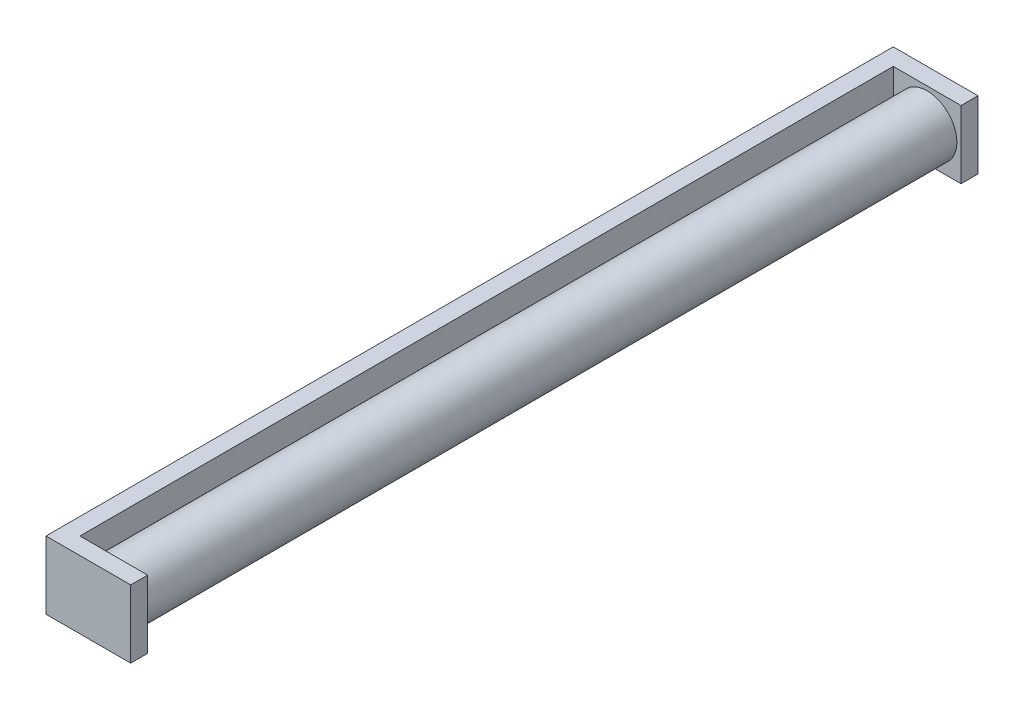
ISO-10303-21;
HEADER;
FILE_DESCRIPTION(('STEP AP214'),'2;1');
FILE_NAME('part.step','',(''),(''),'','','');
FILE_SCHEMA(('AUTOMOTIVE_DESIGN { 1 0 10303 214 1 1 1 1 }'));
ENDSEC;
DATA;
#1=APPLICATION_CONTEXT('core data for automotive mechanical design processes');
#2=APPLICATION_PROTOCOL_DEFINITION('international standard','automotive_design',2000,#1);
#3=PRODUCT_CONTEXT('',#1,'mechanical');
#4=PRODUCT('Part','Part','',(#3));
#5=PRODUCT_RELATED_PRODUCT_CATEGORY('part','',(#4));
#6=PRODUCT_DEFINITION_FORMATION('','',#4);
#7=PRODUCT_DEFINITION_CONTEXT('part definition',#1,'design');
#8=PRODUCT_DEFINITION('design','',#6,#7);
#9=PRODUCT_DEFINITION_SHAPE('','',#8);
#10=(LENGTH_UNIT() NAMED_UNIT(*) SI_UNIT(.MILLI.,.METRE.));
#11=(NAMED_UNIT(*) PLANE_ANGLE_UNIT() SI_UNIT($,.RADIAN.));
#12=(NAMED_UNIT(*) SI_UNIT($,.STERADIAN.) SOLID_ANGLE_UNIT());
#13=UNCERTAINTY_MEASURE_WITH_UNIT(LENGTH_MEASURE(1.E-05),#10,'distance_accuracy_value','');
#14=(GEOMETRIC_REPRESENTATION_CONTEXT(3) GLOBAL_UNCERTAINTY_ASSIGNED_CONTEXT((#13)) GLOBAL_UNIT_ASSIGNED_CONTEXT((#10,
#11,#12)) REPRESENTATION_CONTEXT('',''));
#15=CARTESIAN_POINT('',(0.,0.,0.));
#16=DIRECTION('',(0.,0.,1.));
#17=DIRECTION('',(1.,0.,0.));
#18=AXIS2_PLACEMENT_3D('',#15,#16,#17);
#19=CARTESIAN_POINT('',(20.,0.,0.));
#20=DIRECTION('',(-1.,0.,0.));
#21=DIRECTION('',(0.,0.,1.));
#22=AXIS2_PLACEMENT_3D('',#19,#20,#21);
#23=PLANE('',#22);
#24=DIRECTION('',(0.,1.,0.));
#25=VECTOR('',#24,1.);
#26=CARTESIAN_POINT('',(20.,40.,-480.));
#27=LINE('',#26,#25);
#28=CARTESIAN_POINT('',(20.,40.,-480.));
#29=VERTEX_POINT('',#28);
#30=CARTESIAN_POINT('',(20.,-40.,-480.));
#31=VERTEX_POINT('',#30);
#32=EDGE_CURVE('E57',#29,#31,#27,.F.);
#33=ORIENTED_EDGE('',*,*,#32,.F.);
#34=DIRECTION('',(0.,0.,1.));
#35=VECTOR('',#34,1.);
#36=CARTESIAN_POINT('',(20.,40.,500.));
#37=LINE('',#36,#35);
#38=CARTESIAN_POINT('',(20.,40.,480.));
#39=VERTEX_POINT('',#38);
#40=EDGE_CURVE('E39',#29,#39,#37,.T.);
#41=ORIENTED_EDGE('',*,*,#40,.T.);
#42=DIRECTION('',(0.,1.,0.));
#43=VECTOR('',#42,1.);
#44=CARTESIAN_POINT('',(20.,40.,480.));
#45=LINE('',#44,#43);
#46=CARTESIAN_POINT('',(20.,-40.,480.));
#47=VERTEX_POINT('',#46);
#48=EDGE_CURVE('E136',#39,#47,#45,.F.);
#49=ORIENTED_EDGE('',*,*,#48,.T.);
#50=DIRECTION('',(0.,0.,-1.));
#51=VECTOR('',#50,1.);
#52=CARTESIAN_POINT('',(20.,-40.,500.));
#53=LINE('',#52,#51);
#54=EDGE_CURVE('E53',#47,#31,#53,.T.);
#55=ORIENTED_EDGE('',*,*,#54,.T.);
#56=EDGE_LOOP('',(#33,#41,#49,#55));
#57=FACE_BOUND('',#56,.T.);
#58=ADVANCED_FACE('F35',(#57),#23,.F.);
#59=CARTESIAN_POINT('',(20.,-40.,-500.));
#60=DIRECTION('',(0.,0.,1.));
#61=DIRECTION('',(1.,0.,0.));
#62=AXIS2_PLACEMENT_3D('',#59,#60,#61);
#63=PLANE('',#62);
#64=DIRECTION('',(0.,1.,0.));
#65=VECTOR('',#64,1.);
#66=CARTESIAN_POINT('',(0.,-40.,-500.));
#67=LINE('',#66,#65);
#68=CARTESIAN_POINT('',(0.,-40.,-500.));
#69=VERTEX_POINT('',#68);
#70=CARTESIAN_POINT('',(0.,40.,-500.));
#71=VERTEX_POINT('',#70);
#72=EDGE_CURVE('E108',#69,#71,#67,.T.);
#73=ORIENTED_EDGE('',*,*,#72,.T.);
#74=DIRECTION('',(-1.,0.,0.));
#75=VECTOR('',#74,1.);
#76=CARTESIAN_POINT('',(20.,40.,-500.));
#77=LINE('',#76,#75);
#78=CARTESIAN_POINT('',(100.,40.,-500.));
#79=VERTEX_POINT('',#78);
#80=EDGE_CURVE('E45',#79,#71,#77,.T.);
#81=ORIENTED_EDGE('',*,*,#80,.F.);
#82=DIRECTION('',(0.,-1.,0.));
#83=VECTOR('',#82,1.);
#84=CARTESIAN_POINT('',(100.,40.,-500.));
#85=LINE('',#84,#83);
#86=CARTESIAN_POINT('',(100.,-40.,-500.));
#87=VERTEX_POINT('',#86);
#88=EDGE_CURVE('E106',#79,#87,#85,.T.);
#89=ORIENTED_EDGE('',*,*,#88,.T.);
#90=DIRECTION('',(-1.,0.,0.));
#91=VECTOR('',#90,1.);
#92=CARTESIAN_POINT('',(20.,-40.,-500.));
#93=LINE('',#92,#91);
#94=EDGE_CURVE('E171',#87,#69,#93,.T.);
#95=ORIENTED_EDGE('',*,*,#94,.T.);
#96=EDGE_LOOP('',(#73,#81,#89,#95));
#97=FACE_BOUND('',#96,.T.);
#98=ADVANCED_FACE('F37',(#97),#63,.F.);
#99=CARTESIAN_POINT('',(20.,40.,500.));
#100=DIRECTION('',(0.,-1.,0.));
#101=DIRECTION('',(0.,0.,-1.));
#102=AXIS2_PLACEMENT_3D('',#99,#100,#101);
#103=PLANE('',#102);
#104=DIRECTION('',(0.,0.,1.));
#105=VECTOR('',#104,1.);
#106=CARTESIAN_POINT('',(0.,40.,500.));
#107=LINE('',#106,#105);
#108=CARTESIAN_POINT('',(0.,40.,500.));
#109=VERTEX_POINT('',#108);
#110=EDGE_CURVE('E179',#71,#109,#107,.T.);
#111=ORIENTED_EDGE('',*,*,#110,.T.);
#112=DIRECTION('',(-1.,0.,0.));
#113=VECTOR('',#112,1.);
#114=CARTESIAN_POINT('',(20.,40.,500.));
#115=LINE('',#114,#113);
#116=CARTESIAN_POINT('',(100.,40.,500.));
#117=VERTEX_POINT('',#116);
#118=EDGE_CURVE('E110',#117,#109,#115,.T.);
#119=ORIENTED_EDGE('',*,*,#118,.F.);
#120=DIRECTION('',(0.,0.,-1.));
#121=VECTOR('',#120,1.);
#122=CARTESIAN_POINT('',(100.,40.,500.));
#123=LINE('',#122,#121);
#124=CARTESIAN_POINT('',(100.,40.,480.));
#125=VERTEX_POINT('',#124);
#126=EDGE_CURVE('E146',#117,#125,#123,.T.);
#127=ORIENTED_EDGE('',*,*,#126,.T.);
#128=DIRECTION('',(-1.,0.,0.));
#129=VECTOR('',#128,1.);
#130=CARTESIAN_POINT('',(100.,40.,480.));
#131=LINE('',#130,#129);
#132=EDGE_CURVE('E149',#125,#39,#131,.T.);
#133=ORIENTED_EDGE('',*,*,#132,.T.);
#134=ORIENTED_EDGE('',*,*,#40,.F.);
#135=DIRECTION('',(-1.,0.,0.));
#136=VECTOR('',#135,1.);
#137=CARTESIAN_POINT('',(100.,40.,-480.));
#138=LINE('',#137,#136);
#139=CARTESIAN_POINT('',(100.,40.,-480.));
#140=VERTEX_POINT('',#139);
#141=EDGE_CURVE('E116',#140,#29,#138,.T.);
#142=ORIENTED_EDGE('',*,*,#141,.F.);
#143=DIRECTION('',(0.,0.,1.));
#144=VECTOR('',#143,1.);
#145=CARTESIAN_POINT('',(100.,40.,-500.));
#146=LINE('',#145,#144);
#147=EDGE_CURVE('E113',#79,#140,#146,.T.);
#148=ORIENTED_EDGE('',*,*,#147,.F.);
#149=ORIENTED_EDGE('',*,*,#80,.T.);
#150=EDGE_LOOP('',(#111,#119,#127,#133,#134,#142,#148,#149));
#151=FACE_BOUND('',#150,.T.);
#152=ADVANCED_FACE('F114',(#151),#103,.F.);
#153=CARTESIAN_POINT('',(20.,-40.,500.));
#154=DIRECTION('',(0.,0.,-1.));
#155=DIRECTION('',(-1.,0.,0.));
#156=AXIS2_PLACEMENT_3D('',#153,#154,#155);
#157=PLANE('',#156);
#158=DIRECTION('',(0.,-1.,0.));
#159=VECTOR('',#158,1.);
#160=CARTESIAN_POINT('',(0.,-40.,500.));
#161=LINE('',#160,#159);
#162=CARTESIAN_POINT('',(0.,-40.,500.));
#163=VERTEX_POINT('',#162);
#164=EDGE_CURVE('E175',#109,#163,#161,.T.);
#165=ORIENTED_EDGE('',*,*,#164,.T.);
#166=DIRECTION('',(-1.,0.,0.));
#167=VECTOR('',#166,1.);
#168=CARTESIAN_POINT('',(20.,-40.,500.));
#169=LINE('',#168,#167);
#170=CARTESIAN_POINT('',(100.,-40.,500.));
#171=VERTEX_POINT('',#170);
#172=EDGE_CURVE('E172',#171,#163,#169,.T.);
#173=ORIENTED_EDGE('',*,*,#172,.F.);
#174=DIRECTION('',(0.,-1.,0.));
#175=VECTOR('',#174,1.);
#176=CARTESIAN_POINT('',(100.,40.,500.));
#177=LINE('',#176,#175);
#178=EDGE_CURVE('E137',#117,#171,#177,.T.);
#179=ORIENTED_EDGE('',*,*,#178,.F.);
#180=ORIENTED_EDGE('',*,*,#118,.T.);
#181=EDGE_LOOP('',(#165,#173,#179,#180));
#182=FACE_BOUND('',#181,.T.);
#183=ADVANCED_FACE('F188',(#182),#157,.F.);
#184=CARTESIAN_POINT('',(20.,-40.,500.));
#185=DIRECTION('',(0.,1.,0.));
#186=DIRECTION('',(0.,0.,1.));
#187=AXIS2_PLACEMENT_3D('',#184,#185,#186);
#188=PLANE('',#187);
#189=DIRECTION('',(0.,0.,-1.));
#190=VECTOR('',#189,1.);
#191=CARTESIAN_POINT('',(0.,-40.,500.));
#192=LINE('',#191,#190);
#193=EDGE_CURVE('E174',#163,#69,#192,.T.);
#194=ORIENTED_EDGE('',*,*,#193,.T.);
#195=ORIENTED_EDGE('',*,*,#94,.F.);
#196=DIRECTION('',(0.,0.,-1.));
#197=VECTOR('',#196,1.);
#198=CARTESIAN_POINT('',(100.,-40.,-480.));
#199=LINE('',#198,#197);
#200=CARTESIAN_POINT('',(100.,-40.,-480.));
#201=VERTEX_POINT('',#200);
#202=EDGE_CURVE('E124',#201,#87,#199,.T.);
#203=ORIENTED_EDGE('',*,*,#202,.F.);
#204=DIRECTION('',(-1.,0.,0.));
#205=VECTOR('',#204,1.);
#206=CARTESIAN_POINT('',(100.,-40.,-480.));
#207=LINE('',#206,#205);
#208=EDGE_CURVE('E131',#201,#31,#207,.T.);
#209=ORIENTED_EDGE('',*,*,#208,.T.);
#210=ORIENTED_EDGE('',*,*,#54,.F.);
#211=DIRECTION('',(-1.,0.,0.));
#212=VECTOR('',#211,1.);
#213=CARTESIAN_POINT('',(100.,-40.,480.));
#214=LINE('',#213,#212);
#215=CARTESIAN_POINT('',(100.,-40.,480.));
#216=VERTEX_POINT('',#215);
#217=EDGE_CURVE('E156',#216,#47,#214,.T.);
#218=ORIENTED_EDGE('',*,*,#217,.F.);
#219=DIRECTION('',(0.,0.,1.));
#220=VECTOR('',#219,1.);
#221=CARTESIAN_POINT('',(100.,-40.,480.));
#222=LINE('',#221,#220);
#223=EDGE_CURVE('E140',#216,#171,#222,.T.);
#224=ORIENTED_EDGE('',*,*,#223,.T.);
#225=ORIENTED_EDGE('',*,*,#172,.T.);
#226=EDGE_LOOP('',(#194,#195,#203,#209,#210,#218,#224,#225));
#227=FACE_BOUND('',#226,.T.);
#228=ADVANCED_FACE('F168',(#227),#188,.F.);
#229=CARTESIAN_POINT('',(0.,0.,0.));
#230=DIRECTION('',(-1.,0.,0.));
#231=DIRECTION('',(0.,0.,1.));
#232=AXIS2_PLACEMENT_3D('',#229,#230,#231);
#233=PLANE('',#232);
#234=ORIENTED_EDGE('',*,*,#72,.F.);
#235=ORIENTED_EDGE('',*,*,#193,.F.);
#236=ORIENTED_EDGE('',*,*,#164,.F.);
#237=ORIENTED_EDGE('',*,*,#110,.F.);
#238=EDGE_LOOP('',(#234,#235,#236,#237));
#239=FACE_BOUND('',#238,.T.);
#240=ADVANCED_FACE('F190',(#239),#233,.T.);
#241=CARTESIAN_POINT('',(100.,40.,480.));
#242=DIRECTION('',(0.,0.,-1.));
#243=DIRECTION('',(-1.,0.,0.));
#244=AXIS2_PLACEMENT_3D('',#241,#242,#243);
#245=PLANE('',#244);
#246=CARTESIAN_POINT('',(60.,0.,480.));
#247=DIRECTION('',(0.,0.,-1.));
#248=DIRECTION('',(-1.,0.,0.));
#249=AXIS2_PLACEMENT_3D('',#246,#247,#248);
#250=CIRCLE('',#249,35.);
#251=CARTESIAN_POINT('',(25.,0.,480.));
#252=VERTEX_POINT('',#251);
#253=EDGE_CURVE('E11',#252,#252,#250,.T.);
#254=ORIENTED_EDGE('',*,*,#253,.F.);
#255=EDGE_LOOP('',(#254));
#256=FACE_BOUND('',#255,.T.);
#257=ORIENTED_EDGE('',*,*,#48,.F.);
#258=ORIENTED_EDGE('',*,*,#132,.F.);
#259=DIRECTION('',(0.,1.,0.));
#260=VECTOR('',#259,1.);
#261=CARTESIAN_POINT('',(100.,40.,480.));
#262=LINE('',#261,#260);
#263=EDGE_CURVE('E143',#125,#216,#262,.F.);
#264=ORIENTED_EDGE('',*,*,#263,.T.);
#265=ORIENTED_EDGE('',*,*,#217,.T.);
#266=EDGE_LOOP('',(#257,#258,#264,#265));
#267=FACE_BOUND('',#266,.T.);
#268=ADVANCED_FACE('F166',(#256,#267),#245,.T.);
#269=CARTESIAN_POINT('',(100.,0.,0.));
#270=DIRECTION('',(-1.,0.,0.));
#271=DIRECTION('',(0.,0.,1.));
#272=AXIS2_PLACEMENT_3D('',#269,#270,#271);
#273=PLANE('',#272);
#274=ORIENTED_EDGE('',*,*,#178,.T.);
#275=ORIENTED_EDGE('',*,*,#223,.F.);
#276=ORIENTED_EDGE('',*,*,#263,.F.);
#277=ORIENTED_EDGE('',*,*,#126,.F.);
#278=EDGE_LOOP('',(#274,#275,#276,#277));
#279=FACE_BOUND('',#278,.T.);
#280=ADVANCED_FACE('F199',(#279),#273,.F.);
#281=CARTESIAN_POINT('',(100.,40.,-480.));
#282=DIRECTION('',(0.,0.,-1.));
#283=DIRECTION('',(-1.,0.,0.));
#284=AXIS2_PLACEMENT_3D('',#281,#282,#283);
#285=PLANE('',#284);
#286=CARTESIAN_POINT('',(60.,0.,-480.));
#287=DIRECTION('',(0.,0.,-1.));
#288=DIRECTION('',(-1.,0.,0.));
#289=AXIS2_PLACEMENT_3D('',#286,#287,#288);
#290=CIRCLE('',#289,35.);
#291=CARTESIAN_POINT('',(25.,0.,-480.));
#292=VERTEX_POINT('',#291);
#293=EDGE_CURVE('E126',#292,#292,#290,.F.);
#294=ORIENTED_EDGE('',*,*,#293,.F.);
#295=EDGE_LOOP('',(#294));
#296=FACE_BOUND('',#295,.T.);
#297=ORIENTED_EDGE('',*,*,#32,.T.);
#298=ORIENTED_EDGE('',*,*,#208,.F.);
#299=DIRECTION('',(0.,1.,0.));
#300=VECTOR('',#299,1.);
#301=CARTESIAN_POINT('',(100.,40.,-480.));
#302=LINE('',#301,#300);
#303=EDGE_CURVE('E119',#140,#201,#302,.F.);
#304=ORIENTED_EDGE('',*,*,#303,.F.);
#305=ORIENTED_EDGE('',*,*,#141,.T.);
#306=EDGE_LOOP('',(#297,#298,#304,#305));
#307=FACE_BOUND('',#306,.T.);
#308=ADVANCED_FACE('F211',(#296,#307),#285,.F.);
#309=CARTESIAN_POINT('',(100.,0.,0.));
#310=DIRECTION('',(-1.,0.,0.));
#311=DIRECTION('',(0.,0.,-1.));
#312=AXIS2_PLACEMENT_3D('',#309,#310,#311);
#313=PLANE('',#312);
#314=ORIENTED_EDGE('',*,*,#88,.F.);
#315=ORIENTED_EDGE('',*,*,#147,.T.);
#316=ORIENTED_EDGE('',*,*,#303,.T.);
#317=ORIENTED_EDGE('',*,*,#202,.T.);
#318=EDGE_LOOP('',(#314,#315,#316,#317));
#319=FACE_BOUND('',#318,.T.);
#320=ADVANCED_FACE('F122',(#319),#313,.F.);
#321=CARTESIAN_POINT('',(60.,0.,-578.994949366117));
#322=DIRECTION('',(0.,0.,1.));
#323=DIRECTION('',(1.,0.,0.));
#324=AXIS2_PLACEMENT_3D('',#321,#322,#323);
#325=CYLINDRICAL_SURFACE('',#324,35.);
#326=ORIENTED_EDGE('',*,*,#253,.T.);
#327=EDGE_LOOP('',(#326));
#328=FACE_BOUND('',#327,.T.);
#329=ORIENTED_EDGE('',*,*,#293,.T.);
#330=EDGE_LOOP('',(#329));
#331=FACE_BOUND('',#330,.T.);
#332=ADVANCED_FACE('F218',(#328,#331),#325,.T.);
#333=CLOSED_SHELL('',(#58,#98,#152,#183,#228,#240,#268,#280,#308,#320,#332));
#334=MANIFOLD_SOLID_BREP('B2',#333);
#335=ADVANCED_BREP_SHAPE_REPRESENTATION('',(#18,#334),#14);
#336=SHAPE_DEFINITION_REPRESENTATION(#9,#335);
ENDSEC;
END-ISO-10303-21;
